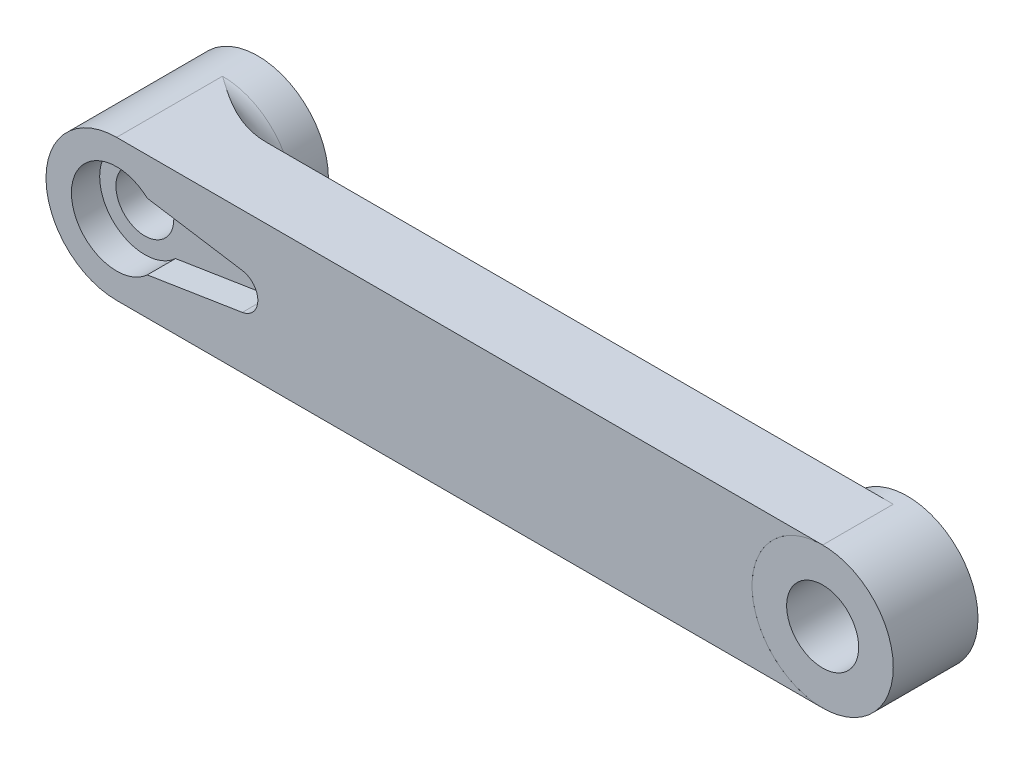
ISO-10303-21;
HEADER;
FILE_DESCRIPTION(('STEP AP214'),'2;1');
FILE_NAME('part.step','',(''),(''),'','','');
FILE_SCHEMA(('AUTOMOTIVE_DESIGN { 1 0 10303 214 1 1 1 1 }'));
ENDSEC;
DATA;
#1=APPLICATION_CONTEXT('core data for automotive mechanical design processes');
#2=APPLICATION_PROTOCOL_DEFINITION('international standard','automotive_design',2000,#1);
#3=PRODUCT_CONTEXT('',#1,'mechanical');
#4=PRODUCT('Part','Part','',(#3));
#5=PRODUCT_RELATED_PRODUCT_CATEGORY('part','',(#4));
#6=PRODUCT_DEFINITION_FORMATION('','',#4);
#7=PRODUCT_DEFINITION_CONTEXT('part definition',#1,'design');
#8=PRODUCT_DEFINITION('design','',#6,#7);
#9=PRODUCT_DEFINITION_SHAPE('','',#8);
#10=(LENGTH_UNIT() NAMED_UNIT(*) SI_UNIT(.MILLI.,.METRE.));
#11=(NAMED_UNIT(*) PLANE_ANGLE_UNIT() SI_UNIT($,.RADIAN.));
#12=(NAMED_UNIT(*) SI_UNIT($,.STERADIAN.) SOLID_ANGLE_UNIT());
#13=UNCERTAINTY_MEASURE_WITH_UNIT(LENGTH_MEASURE(1.E-05),#10,'distance_accuracy_value','');
#14=(GEOMETRIC_REPRESENTATION_CONTEXT(3) GLOBAL_UNCERTAINTY_ASSIGNED_CONTEXT((#13)) GLOBAL_UNIT_ASSIGNED_CONTEXT((#10,
#11,#12)) REPRESENTATION_CONTEXT('',''));
#15=CARTESIAN_POINT('',(0.,0.,0.));
#16=DIRECTION('',(0.,0.,1.));
#17=DIRECTION('',(1.,0.,0.));
#18=AXIS2_PLACEMENT_3D('',#15,#16,#17);
#19=CARTESIAN_POINT('',(100.,0.,-12.));
#20=DIRECTION('',(0.,0.,1.));
#21=DIRECTION('',(1.,0.,0.));
#22=AXIS2_PLACEMENT_3D('',#19,#20,#21);
#23=CYLINDRICAL_SURFACE('',#22,5.1);
#24=CARTESIAN_POINT('',(100.,0.,-12.));
#25=DIRECTION('',(0.,0.,1.));
#26=DIRECTION('',(1.,0.,0.));
#27=AXIS2_PLACEMENT_3D('',#24,#25,#26);
#28=CIRCLE('',#27,5.1);
#29=CARTESIAN_POINT('',(105.1,0.,-12.));
#30=VERTEX_POINT('',#29);
#31=EDGE_CURVE('E51',#30,#30,#28,.T.);
#32=ORIENTED_EDGE('',*,*,#31,.F.);
#33=EDGE_LOOP('',(#32));
#34=FACE_BOUND('',#33,.T.);
#35=CARTESIAN_POINT('',(100.,0.,0.));
#36=DIRECTION('',(0.,0.,1.));
#37=DIRECTION('',(1.,0.,0.));
#38=AXIS2_PLACEMENT_3D('',#35,#36,#37);
#39=CIRCLE('',#38,5.1);
#40=CARTESIAN_POINT('',(105.1,0.,0.));
#41=VERTEX_POINT('',#40);
#42=EDGE_CURVE('E57',#41,#41,#39,.T.);
#43=ORIENTED_EDGE('',*,*,#42,.T.);
#44=EDGE_LOOP('',(#43));
#45=FACE_BOUND('',#44,.T.);
#46=ADVANCED_FACE('F44',(#34,#45),#23,.F.);
#47=CARTESIAN_POINT('',(100.,0.,-12.));
#48=DIRECTION('',(0.,0.,1.));
#49=DIRECTION('',(1.,0.,0.));
#50=AXIS2_PLACEMENT_3D('',#47,#48,#49);
#51=CYLINDRICAL_SURFACE('',#50,9.99999999999999);
#52=CARTESIAN_POINT('',(100.,0.,-12.));
#53=DIRECTION('',(0.,0.,1.));
#54=DIRECTION('',(1.,0.,0.));
#55=AXIS2_PLACEMENT_3D('',#52,#53,#54);
#56=CIRCLE('',#55,9.99999999999999);
#57=CARTESIAN_POINT('',(110.,0.,-12.));
#58=VERTEX_POINT('',#57);
#59=EDGE_CURVE('E11',#58,#58,#56,.T.);
#60=ORIENTED_EDGE('',*,*,#59,.T.);
#61=EDGE_LOOP('',(#60));
#62=FACE_BOUND('',#61,.T.);
#63=CARTESIAN_POINT('',(100.,0.,0.));
#64=DIRECTION('',(0.,0.,1.));
#65=DIRECTION('',(1.,0.,0.));
#66=AXIS2_PLACEMENT_3D('',#63,#64,#65);
#67=CIRCLE('',#66,9.99999999999999);
#68=CARTESIAN_POINT('',(110.,0.,0.));
#69=VERTEX_POINT('',#68);
#70=EDGE_CURVE('E47',#69,#69,#67,.T.);
#71=ORIENTED_EDGE('',*,*,#70,.F.);
#72=EDGE_LOOP('',(#71));
#73=FACE_BOUND('',#72,.T.);
#74=ADVANCED_FACE('F66',(#62,#73),#51,.T.);
#75=CARTESIAN_POINT('',(0.,0.,-12.));
#76=DIRECTION('',(0.,0.,1.));
#77=DIRECTION('',(1.,0.,0.));
#78=AXIS2_PLACEMENT_3D('',#75,#76,#77);
#79=PLANE('',#78);
#80=ORIENTED_EDGE('',*,*,#31,.T.);
#81=EDGE_LOOP('',(#80));
#82=FACE_BOUND('',#81,.T.);
#83=ORIENTED_EDGE('',*,*,#59,.F.);
#84=EDGE_LOOP('',(#83));
#85=FACE_BOUND('',#84,.T.);
#86=ADVANCED_FACE('F68',(#82,#85),#79,.F.);
#87=CARTESIAN_POINT('',(0.,0.,0.));
#88=DIRECTION('',(0.,0.,1.));
#89=DIRECTION('',(1.,0.,0.));
#90=AXIS2_PLACEMENT_3D('',#87,#88,#89);
#91=PLANE('',#90);
#92=ORIENTED_EDGE('',*,*,#42,.F.);
#93=EDGE_LOOP('',(#92));
#94=FACE_BOUND('',#93,.T.);
#95=ORIENTED_EDGE('',*,*,#70,.T.);
#96=EDGE_LOOP('',(#95));
#97=FACE_BOUND('',#96,.T.);
#98=ADVANCED_FACE('F64',(#94,#97),#91,.T.);
#99=CLOSED_SHELL('',(#46,#74,#86,#98));
#100=MANIFOLD_SOLID_BREP('B2',#99);
#101=CARTESIAN_POINT('',(0.,0.,-20.));
#102=DIRECTION('',(0.,0.,1.));
#103=DIRECTION('',(1.,0.,0.));
#104=AXIS2_PLACEMENT_3D('',#101,#102,#103);
#105=CYLINDRICAL_SURFACE('',#104,4.1);
#106=CARTESIAN_POINT('',(0.,0.,-19.));
#107=DIRECTION('',(0.,0.,1.));
#108=DIRECTION('',(1.,0.,0.));
#109=AXIS2_PLACEMENT_3D('',#106,#107,#108);
#110=CIRCLE('',#109,4.1);
#111=CARTESIAN_POINT('',(4.1,0.,-19.));
#112=VERTEX_POINT('',#111);
#113=EDGE_CURVE('E257',#112,#112,#110,.F.);
#114=ORIENTED_EDGE('',*,*,#113,.T.);
#115=EDGE_LOOP('',(#114));
#116=FACE_BOUND('',#115,.T.);
#117=CARTESIAN_POINT('',(0.,0.,-4.));
#118=DIRECTION('',(0.,0.,1.));
#119=DIRECTION('',(1.,0.,0.));
#120=AXIS2_PLACEMENT_3D('',#117,#118,#119);
#121=CIRCLE('',#120,4.1);
#122=CARTESIAN_POINT('',(4.1,0.,-4.));
#123=VERTEX_POINT('',#122);
#124=EDGE_CURVE('E200',#123,#123,#121,.F.);
#125=ORIENTED_EDGE('',*,*,#124,.F.);
#126=EDGE_LOOP('',(#125));
#127=FACE_BOUND('',#126,.T.);
#128=ADVANCED_FACE('F105',(#116,#127),#105,.F.);
#129=CARTESIAN_POINT('',(0.,0.,-20.));
#130=DIRECTION('',(0.,0.,1.));
#131=DIRECTION('',(1.,0.,0.));
#132=AXIS2_PLACEMENT_3D('',#129,#130,#131);
#133=CYLINDRICAL_SURFACE('',#132,10.);
#134=CARTESIAN_POINT('',(0.,0.,-20.));
#135=DIRECTION('',(0.,0.,1.));
#136=DIRECTION('',(1.,0.,0.));
#137=AXIS2_PLACEMENT_3D('',#134,#135,#136);
#138=CIRCLE('',#137,10.);
#139=CARTESIAN_POINT('',(10.,0.,-20.));
#140=VERTEX_POINT('',#139);
#141=EDGE_CURVE('E249',#140,#140,#138,.T.);
#142=ORIENTED_EDGE('',*,*,#141,.T.);
#143=EDGE_LOOP('',(#142));
#144=FACE_BOUND('',#143,.T.);
#145=DIRECTION('',(0.,0.,1.));
#146=VECTOR('',#145,1.);
#147=CARTESIAN_POINT('',(0.,10.,-10.));
#148=LINE('',#147,#146);
#149=CARTESIAN_POINT('',(0.,10.,-15.));
#150=VERTEX_POINT('',#149);
#151=CARTESIAN_POINT('',(0.,10.,0.));
#152=VERTEX_POINT('',#151);
#153=EDGE_CURVE('E125',#150,#152,#148,.T.);
#154=ORIENTED_EDGE('',*,*,#153,.F.);
#155=CARTESIAN_POINT('',(0.,0.,-15.));
#156=DIRECTION('',(0.,0.,1.));
#157=DIRECTION('',(1.,0.,0.));
#158=AXIS2_PLACEMENT_3D('',#155,#156,#157);
#159=CIRCLE('',#158,10.);
#160=CARTESIAN_POINT('',(0.,-10.,-15.));
#161=VERTEX_POINT('',#160);
#162=EDGE_CURVE('E263',#150,#161,#159,.F.);
#163=ORIENTED_EDGE('',*,*,#162,.T.);
#164=DIRECTION('',(0.,0.,1.));
#165=VECTOR('',#164,1.);
#166=CARTESIAN_POINT('',(0.,-10.,-10.));
#167=LINE('',#166,#165);
#168=CARTESIAN_POINT('',(0.,-10.,0.));
#169=VERTEX_POINT('',#168);
#170=EDGE_CURVE('E132',#161,#169,#167,.T.);
#171=ORIENTED_EDGE('',*,*,#170,.T.);
#172=CARTESIAN_POINT('',(0.,0.,0.));
#173=DIRECTION('',(0.,0.,1.));
#174=DIRECTION('',(1.,0.,0.));
#175=AXIS2_PLACEMENT_3D('',#172,#173,#174);
#176=CIRCLE('',#175,10.);
#177=EDGE_CURVE('E242',#152,#169,#176,.T.);
#178=ORIENTED_EDGE('',*,*,#177,.F.);
#179=EDGE_LOOP('',(#154,#163,#171,#178));
#180=FACE_BOUND('',#179,.T.);
#181=ADVANCED_FACE('F287',(#144,#180),#133,.T.);
#182=CARTESIAN_POINT('',(0.,0.,-20.));
#183=DIRECTION('',(0.,0.,1.));
#184=DIRECTION('',(1.,0.,0.));
#185=AXIS2_PLACEMENT_3D('',#182,#183,#184);
#186=PLANE('',#185);
#187=CARTESIAN_POINT('',(0.,0.,-20.));
#188=DIRECTION('',(0.,0.,1.));
#189=DIRECTION('',(1.,0.,0.));
#190=AXIS2_PLACEMENT_3D('',#187,#188,#189);
#191=CIRCLE('',#190,5.10000000000001);
#192=CARTESIAN_POINT('',(5.10000000000001,0.,-20.));
#193=VERTEX_POINT('',#192);
#194=EDGE_CURVE('E252',#193,#193,#191,.T.);
#195=ORIENTED_EDGE('',*,*,#194,.T.);
#196=EDGE_LOOP('',(#195));
#197=FACE_BOUND('',#196,.T.);
#198=ORIENTED_EDGE('',*,*,#141,.F.);
#199=EDGE_LOOP('',(#198));
#200=FACE_BOUND('',#199,.T.);
#201=ADVANCED_FACE('F284',(#197,#200),#186,.F.);
#202=CARTESIAN_POINT('',(0.,0.,0.));
#203=DIRECTION('',(0.,0.,1.));
#204=DIRECTION('',(1.,0.,0.));
#205=AXIS2_PLACEMENT_3D('',#202,#203,#204);
#206=PLANE('',#205);
#207=CARTESIAN_POINT('',(17.4,0.,0.));
#208=DIRECTION('',(0.,0.,1.));
#209=DIRECTION('',(1.,0.,0.));
#210=AXIS2_PLACEMENT_3D('',#207,#208,#209);
#211=CIRCLE('',#210,2.6);
#212=CARTESIAN_POINT('',(17.8067296091046,-2.56798968554736,0.));
#213=VERTEX_POINT('',#212);
#214=CARTESIAN_POINT('',(17.8067296091046,2.56798968554736,0.));
#215=VERTEX_POINT('',#214);
#216=EDGE_CURVE('E199',#213,#215,#211,.T.);
#217=ORIENTED_EDGE('',*,*,#216,.F.);
#218=DIRECTION('',(0.987688340595138,0.156434465040231,0.));
#219=VECTOR('',#218,1.);
#220=CARTESIAN_POINT('',(0.832537917336765,-5.2564375366094,0.));
#221=LINE('',#220,#219);
#222=CARTESIAN_POINT('',(4.34359215751142,-4.70034117583025,0.));
#223=VERTEX_POINT('',#222);
#224=EDGE_CURVE('E206',#223,#213,#221,.T.);
#225=ORIENTED_EDGE('',*,*,#224,.F.);
#226=CARTESIAN_POINT('',(0.,0.,0.));
#227=DIRECTION('',(0.,0.,1.));
#228=DIRECTION('',(1.,0.,0.));
#229=AXIS2_PLACEMENT_3D('',#226,#227,#228);
#230=CIRCLE('',#229,6.4);
#231=CARTESIAN_POINT('',(4.34359215751142,4.70034117583025,0.));
#232=VERTEX_POINT('',#231);
#233=EDGE_CURVE('E209',#232,#223,#230,.T.);
#234=ORIENTED_EDGE('',*,*,#233,.F.);
#235=DIRECTION('',(0.987688340595138,-0.156434465040231,0.));
#236=VECTOR('',#235,1.);
#237=CARTESIAN_POINT('',(0.832537917336765,5.2564375366094,0.));
#238=LINE('',#237,#236);
#239=EDGE_CURVE('E217',#232,#215,#238,.T.);
#240=ORIENTED_EDGE('',*,*,#239,.T.);
#241=EDGE_LOOP('',(#217,#225,#234,#240));
#242=FACE_BOUND('',#241,.T.);
#243=ORIENTED_EDGE('',*,*,#177,.T.);
#244=DIRECTION('',(1.,0.,0.));
#245=VECTOR('',#244,1.);
#246=CARTESIAN_POINT('',(0.,-10.,0.));
#247=LINE('',#246,#245);
#248=CARTESIAN_POINT('',(100.,-9.99999999999999,0.));
#249=VERTEX_POINT('',#248);
#250=EDGE_CURVE('E223',#169,#249,#247,.T.);
#251=ORIENTED_EDGE('',*,*,#250,.T.);
#252=CARTESIAN_POINT('',(100.,0.,0.));
#253=DIRECTION('',(0.,0.,1.));
#254=DIRECTION('',(1.,0.,0.));
#255=AXIS2_PLACEMENT_3D('',#252,#253,#254);
#256=CIRCLE('',#255,9.99999999999999);
#257=CARTESIAN_POINT('',(100.,9.99999999999999,0.));
#258=VERTEX_POINT('',#257);
#259=EDGE_CURVE('E237',#258,#249,#256,.T.);
#260=ORIENTED_EDGE('',*,*,#259,.F.);
#261=DIRECTION('',(1.,0.,0.));
#262=VECTOR('',#261,1.);
#263=CARTESIAN_POINT('',(0.,10.,0.));
#264=LINE('',#263,#262);
#265=EDGE_CURVE('E230',#152,#258,#264,.T.);
#266=ORIENTED_EDGE('',*,*,#265,.F.);
#267=EDGE_LOOP('',(#243,#251,#260,#266));
#268=FACE_BOUND('',#267,.T.);
#269=ADVANCED_FACE('F274',(#242,#268),#206,.T.);
#270=CARTESIAN_POINT('',(0.,10.,-10.));
#271=DIRECTION('',(0.,-1.,0.));
#272=DIRECTION('',(1.,0.,0.));
#273=AXIS2_PLACEMENT_3D('',#270,#271,#272);
#274=PLANE('',#273);
#275=ORIENTED_EDGE('',*,*,#265,.T.);
#276=DIRECTION('',(0.,0.,1.));
#277=VECTOR('',#276,1.);
#278=CARTESIAN_POINT('',(100.,9.99999999999999,-10.));
#279=LINE('',#278,#277);
#280=CARTESIAN_POINT('',(100.,9.99999999999999,-10.));
#281=VERTEX_POINT('',#280);
#282=EDGE_CURVE('E243',#281,#258,#279,.T.);
#283=ORIENTED_EDGE('',*,*,#282,.F.);
#284=DIRECTION('',(1.,0.,0.));
#285=VECTOR('',#284,1.);
#286=CARTESIAN_POINT('',(0.,10.,-10.));
#287=LINE('',#286,#285);
#288=CARTESIAN_POINT('',(11.1803398874989,10.,-10.));
#289=VERTEX_POINT('',#288);
#290=EDGE_CURVE('E233',#289,#281,#287,.T.);
#291=ORIENTED_EDGE('',*,*,#290,.F.);
#292=CARTESIAN_POINT('',(11.1803398874989,10.,-10.));
#293=CARTESIAN_POINT('',(10.8833418810393,10.,-10.0000299623993));
#294=CARTESIAN_POINT('',(10.586723603073,10.,-10.0146927876897));
#295=CARTESIAN_POINT('',(9.99650368330965,10.,-10.0702146909149));
#296=CARTESIAN_POINT('',(9.7028972040913,10.,-10.1110214521143));
#297=CARTESIAN_POINT('',(8.83797284787225,10.,-10.2664109142398));
#298=CARTESIAN_POINT('',(8.27249718229531,10.,-10.4141798049535));
#299=CARTESIAN_POINT('',(7.41580997338312,10.,-10.6955481168027));
#300=CARTESIAN_POINT('',(7.11620351047925,10.,-10.8053404310762));
#301=CARTESIAN_POINT('',(6.52395825241381,10.,-11.0424122981148));
#302=CARTESIAN_POINT('',(6.23131919380734,10.,-11.169691188458));
#303=CARTESIAN_POINT('',(5.36306780758409,10.,-11.5738498936846));
#304=CARTESIAN_POINT('',(4.79777598845146,10.,-11.8728243117631));
#305=CARTESIAN_POINT('',(3.68544002130758,10.,-12.5128801469089));
#306=CARTESIAN_POINT('',(3.13860738175161,10.,-12.8543182334579));
#307=CARTESIAN_POINT('',(2.06078067546994,10.,-13.5604488420561));
#308=CARTESIAN_POINT('',(1.52977958409369,10.,-13.9251308181446));
#309=CARTESIAN_POINT('',(0.672566535979779,10.,-14.5244681553938));
#310=CARTESIAN_POINT('',(0.344440515491117,10.,-14.7564445011615));
#311=CARTESIAN_POINT('',(0.0108866222775107,10.,-14.9923019952232));
#312=CARTESIAN_POINT('',(0.00544331176375164,10.,-14.9961509970116));
#313=CARTESIAN_POINT('',(0.,10.,-15.));
#314=B_SPLINE_CURVE_WITH_KNOTS('',3,(#292,#293,#294,#295,#296,#297,#298,#299,#300,#301,#302,
#303,#304,#305,#306,#307,#308,#309,#310,#311,#312,#313),.UNSPECIFIED.,.F.,.F.,(4,2,2,2,2,2,2,2,
2,2,4),(0.,0.890035292464625,1.77829507120259,3.52501481011829,4.48189649503703,
5.43874194160516,7.35450080314867,9.28760187109391,11.2198320325017,12.4253863415644,
12.4453863415646),.UNSPECIFIED.);
#315=EDGE_CURVE('E118',#289,#150,#314,.T.);
#316=ORIENTED_EDGE('',*,*,#315,.T.);
#317=ORIENTED_EDGE('',*,*,#153,.T.);
#318=EDGE_LOOP('',(#275,#283,#291,#316,#317));
#319=FACE_BOUND('',#318,.T.);
#320=ADVANCED_FACE('F268',(#319),#274,.F.);
#321=CARTESIAN_POINT('',(100.,0.,-10.));
#322=DIRECTION('',(0.,0.,1.));
#323=DIRECTION('',(1.,0.,0.));
#324=AXIS2_PLACEMENT_3D('',#321,#322,#323);
#325=CYLINDRICAL_SURFACE('',#324,9.99999999999999);
#326=ORIENTED_EDGE('',*,*,#259,.T.);
#327=DIRECTION('',(0.,0.,1.));
#328=VECTOR('',#327,1.);
#329=CARTESIAN_POINT('',(100.,-9.99999999999999,-10.));
#330=LINE('',#329,#328);
#331=CARTESIAN_POINT('',(100.,-9.99999999999999,-10.));
#332=VERTEX_POINT('',#331);
#333=EDGE_CURVE('E246',#332,#249,#330,.T.);
#334=ORIENTED_EDGE('',*,*,#333,.F.);
#335=CARTESIAN_POINT('',(100.,0.,-10.));
#336=DIRECTION('',(0.,0.,1.));
#337=DIRECTION('',(1.,0.,0.));
#338=AXIS2_PLACEMENT_3D('',#335,#336,#337);
#339=CIRCLE('',#338,9.99999999999999);
#340=EDGE_CURVE('E229',#281,#332,#339,.T.);
#341=ORIENTED_EDGE('',*,*,#340,.F.);
#342=ORIENTED_EDGE('',*,*,#282,.T.);
#343=EDGE_LOOP('',(#326,#334,#341,#342));
#344=FACE_BOUND('',#343,.T.);
#345=ADVANCED_FACE('F273',(#344),#325,.F.);
#346=CARTESIAN_POINT('',(0.,-10.,-10.));
#347=DIRECTION('',(0.,-1.,0.));
#348=DIRECTION('',(1.,0.,0.));
#349=AXIS2_PLACEMENT_3D('',#346,#347,#348);
#350=PLANE('',#349);
#351=ORIENTED_EDGE('',*,*,#250,.F.);
#352=ORIENTED_EDGE('',*,*,#170,.F.);
#353=CARTESIAN_POINT('',(11.1803398874989,-10.,-10.));
#354=CARTESIAN_POINT('',(10.8833418810393,-10.,-10.0000299623993));
#355=CARTESIAN_POINT('',(10.586723603073,-10.,-10.0146927876897));
#356=CARTESIAN_POINT('',(9.99650368330965,-10.,-10.0702146909149));
#357=CARTESIAN_POINT('',(9.7028972040913,-10.,-10.1110214521143));
#358=CARTESIAN_POINT('',(8.83797284787225,-10.,-10.2664109142398));
#359=CARTESIAN_POINT('',(8.27249718229531,-10.,-10.4141798049535));
#360=CARTESIAN_POINT('',(7.41580997338312,-10.,-10.6955481168027));
#361=CARTESIAN_POINT('',(7.11620351047925,-10.,-10.8053404310762));
#362=CARTESIAN_POINT('',(6.52395825241381,-10.,-11.0424122981148));
#363=CARTESIAN_POINT('',(6.23131919380734,-10.,-11.169691188458));
#364=CARTESIAN_POINT('',(5.36306780758409,-10.,-11.5738498936846));
#365=CARTESIAN_POINT('',(4.79777598845146,-10.,-11.8728243117631));
#366=CARTESIAN_POINT('',(3.68544002130758,-10.,-12.5128801469089));
#367=CARTESIAN_POINT('',(3.13860738175161,-10.,-12.8543182334579));
#368=CARTESIAN_POINT('',(2.06078067546994,-10.,-13.5604488420561));
#369=CARTESIAN_POINT('',(1.52977958409369,-10.,-13.9251308181446));
#370=CARTESIAN_POINT('',(0.672566535979779,-10.,-14.5244681553938));
#371=CARTESIAN_POINT('',(0.344440515491117,-10.,-14.7564445011615));
#372=CARTESIAN_POINT('',(0.0108866222775107,-10.,-14.9923019952232));
#373=CARTESIAN_POINT('',(0.00544331176375164,-10.,-14.9961509970116));
#374=CARTESIAN_POINT('',(0.,-10.,-15.));
#375=B_SPLINE_CURVE_WITH_KNOTS('',3,(#353,#354,#355,#356,#357,#358,#359,#360,#361,#362,#363,
#364,#365,#366,#367,#368,#369,#370,#371,#372,#373,#374),.UNSPECIFIED.,.F.,.F.,(4,2,2,2,2,2,2,2,
2,2,4),(0.,0.890035292464625,1.77829507120259,3.52501481011829,4.48189649503703,
5.43874194160516,7.35450080314867,9.28760187109391,11.2198320325017,12.4253863415644,
12.4453863415646),.UNSPECIFIED.);
#376=CARTESIAN_POINT('',(11.1803398874989,-10.,-10.));
#377=VERTEX_POINT('',#376);
#378=EDGE_CURVE('E42',#161,#377,#375,.F.);
#379=ORIENTED_EDGE('',*,*,#378,.T.);
#380=DIRECTION('',(1.,0.,0.));
#381=VECTOR('',#380,1.);
#382=CARTESIAN_POINT('',(0.,-10.,-10.));
#383=LINE('',#382,#381);
#384=EDGE_CURVE('E227',#377,#332,#383,.T.);
#385=ORIENTED_EDGE('',*,*,#384,.T.);
#386=ORIENTED_EDGE('',*,*,#333,.T.);
#387=EDGE_LOOP('',(#351,#352,#379,#385,#386));
#388=FACE_BOUND('',#387,.T.);
#389=ADVANCED_FACE('F279',(#388),#350,.T.);
#390=CARTESIAN_POINT('',(0.,0.,-10.));
#391=DIRECTION('',(0.,0.,1.));
#392=DIRECTION('',(1.,0.,0.));
#393=AXIS2_PLACEMENT_3D('',#390,#391,#392);
#394=PLANE('',#393);
#395=ORIENTED_EDGE('',*,*,#384,.F.);
#396=CARTESIAN_POINT('',(0.,0.,-10.));
#397=DIRECTION('',(0.,0.,1.));
#398=DIRECTION('',(1.,0.,0.));
#399=AXIS2_PLACEMENT_3D('',#396,#397,#398);
#400=CIRCLE('',#399,15.);
#401=EDGE_CURVE('E260',#377,#289,#400,.T.);
#402=ORIENTED_EDGE('',*,*,#401,.T.);
#403=ORIENTED_EDGE('',*,*,#290,.T.);
#404=ORIENTED_EDGE('',*,*,#340,.T.);
#405=EDGE_LOOP('',(#395,#402,#403,#404));
#406=FACE_BOUND('',#405,.T.);
#407=ADVANCED_FACE('F276',(#406),#394,.F.);
#408=CARTESIAN_POINT('',(17.4,0.,-4.));
#409=DIRECTION('',(0.,0.,1.));
#410=DIRECTION('',(1.,0.,0.));
#411=AXIS2_PLACEMENT_3D('',#408,#409,#410);
#412=CYLINDRICAL_SURFACE('',#411,2.6);
#413=ORIENTED_EDGE('',*,*,#216,.T.);
#414=DIRECTION('',(0.,0.,1.));
#415=VECTOR('',#414,1.);
#416=CARTESIAN_POINT('',(17.8067296091046,2.56798968554736,-4.));
#417=LINE('',#416,#415);
#418=CARTESIAN_POINT('',(17.8067296091046,2.56798968554736,-4.));
#419=VERTEX_POINT('',#418);
#420=EDGE_CURVE('E184',#419,#215,#417,.T.);
#421=ORIENTED_EDGE('',*,*,#420,.F.);
#422=CARTESIAN_POINT('',(17.4,0.,-4.));
#423=DIRECTION('',(0.,0.,1.));
#424=DIRECTION('',(1.,0.,0.));
#425=AXIS2_PLACEMENT_3D('',#422,#423,#424);
#426=CIRCLE('',#425,2.6);
#427=CARTESIAN_POINT('',(17.8067296091046,-2.56798968554736,-4.));
#428=VERTEX_POINT('',#427);
#429=EDGE_CURVE('E192',#428,#419,#426,.T.);
#430=ORIENTED_EDGE('',*,*,#429,.F.);
#431=DIRECTION('',(0.,0.,1.));
#432=VECTOR('',#431,1.);
#433=CARTESIAN_POINT('',(17.8067296091046,-2.56798968554736,-4.));
#434=LINE('',#433,#432);
#435=EDGE_CURVE('E221',#428,#213,#434,.T.);
#436=ORIENTED_EDGE('',*,*,#435,.T.);
#437=EDGE_LOOP('',(#413,#421,#430,#436));
#438=FACE_BOUND('',#437,.T.);
#439=ADVANCED_FACE('F196',(#438),#412,.F.);
#440=CARTESIAN_POINT('',(0.832537917336765,-5.2564375366094,-4.));
#441=DIRECTION('',(0.156434465040231,-0.987688340595138,0.));
#442=DIRECTION('',(0.987688340595138,0.156434465040231,0.));
#443=AXIS2_PLACEMENT_3D('',#440,#441,#442);
#444=PLANE('',#443);
#445=ORIENTED_EDGE('',*,*,#224,.T.);
#446=ORIENTED_EDGE('',*,*,#435,.F.);
#447=DIRECTION('',(0.987688340595138,0.156434465040231,0.));
#448=VECTOR('',#447,1.);
#449=CARTESIAN_POINT('',(0.832537917336765,-5.2564375366094,-4.));
#450=LINE('',#449,#448);
#451=CARTESIAN_POINT('',(4.34359215751142,-4.70034117583025,-4.));
#452=VERTEX_POINT('',#451);
#453=EDGE_CURVE('E205',#452,#428,#450,.T.);
#454=ORIENTED_EDGE('',*,*,#453,.F.);
#455=DIRECTION('',(0.,0.,1.));
#456=VECTOR('',#455,1.);
#457=CARTESIAN_POINT('',(4.34359215751142,-4.70034117583025,-4.));
#458=LINE('',#457,#456);
#459=EDGE_CURVE('E224',#452,#223,#458,.T.);
#460=ORIENTED_EDGE('',*,*,#459,.T.);
#461=EDGE_LOOP('',(#445,#446,#454,#460));
#462=FACE_BOUND('',#461,.T.);
#463=ADVANCED_FACE('F319',(#462),#444,.F.);
#464=CARTESIAN_POINT('',(0.,0.,-4.));
#465=DIRECTION('',(0.,0.,1.));
#466=DIRECTION('',(1.,0.,0.));
#467=AXIS2_PLACEMENT_3D('',#464,#465,#466);
#468=CYLINDRICAL_SURFACE('',#467,6.4);
#469=ORIENTED_EDGE('',*,*,#233,.T.);
#470=ORIENTED_EDGE('',*,*,#459,.F.);
#471=CARTESIAN_POINT('',(0.,0.,-4.));
#472=DIRECTION('',(0.,0.,1.));
#473=DIRECTION('',(1.,0.,0.));
#474=AXIS2_PLACEMENT_3D('',#471,#472,#473);
#475=CIRCLE('',#474,6.4);
#476=CARTESIAN_POINT('',(4.34359215751142,4.70034117583025,-4.));
#477=VERTEX_POINT('',#476);
#478=EDGE_CURVE('E191',#477,#452,#475,.T.);
#479=ORIENTED_EDGE('',*,*,#478,.F.);
#480=DIRECTION('',(0.,0.,1.));
#481=VECTOR('',#480,1.);
#482=CARTESIAN_POINT('',(4.34359215751142,4.70034117583025,-4.));
#483=LINE('',#482,#481);
#484=EDGE_CURVE('E186',#477,#232,#483,.T.);
#485=ORIENTED_EDGE('',*,*,#484,.T.);
#486=EDGE_LOOP('',(#469,#470,#479,#485));
#487=FACE_BOUND('',#486,.T.);
#488=ADVANCED_FACE('F316',(#487),#468,.F.);
#489=CARTESIAN_POINT('',(0.832537917336765,5.2564375366094,-4.));
#490=DIRECTION('',(-0.156434465040231,-0.987688340595138,0.));
#491=DIRECTION('',(0.987688340595138,-0.156434465040231,0.));
#492=AXIS2_PLACEMENT_3D('',#489,#490,#491);
#493=PLANE('',#492);
#494=ORIENTED_EDGE('',*,*,#239,.F.);
#495=ORIENTED_EDGE('',*,*,#484,.F.);
#496=DIRECTION('',(0.987688340595138,-0.156434465040231,0.));
#497=VECTOR('',#496,1.);
#498=CARTESIAN_POINT('',(0.832537917336765,5.2564375366094,-4.));
#499=LINE('',#498,#497);
#500=EDGE_CURVE('E180',#477,#419,#499,.T.);
#501=ORIENTED_EDGE('',*,*,#500,.T.);
#502=ORIENTED_EDGE('',*,*,#420,.T.);
#503=EDGE_LOOP('',(#494,#495,#501,#502));
#504=FACE_BOUND('',#503,.T.);
#505=ADVANCED_FACE('F183',(#504),#493,.T.);
#506=CARTESIAN_POINT('',(0.,0.,-4.));
#507=DIRECTION('',(0.,0.,1.));
#508=DIRECTION('',(1.,0.,0.));
#509=AXIS2_PLACEMENT_3D('',#506,#507,#508);
#510=PLANE('',#509);
#511=ORIENTED_EDGE('',*,*,#429,.T.);
#512=ORIENTED_EDGE('',*,*,#500,.F.);
#513=ORIENTED_EDGE('',*,*,#478,.T.);
#514=ORIENTED_EDGE('',*,*,#453,.T.);
#515=EDGE_LOOP('',(#511,#512,#513,#514));
#516=FACE_BOUND('',#515,.T.);
#517=ORIENTED_EDGE('',*,*,#124,.T.);
#518=EDGE_LOOP('',(#517));
#519=FACE_BOUND('',#518,.T.);
#520=ADVANCED_FACE('F202',(#516,#519),#510,.T.);
#521=CARTESIAN_POINT('',(0.,0.,-20.));
#522=DIRECTION('',(0.,0.,-1.));
#523=DIRECTION('',(-1.,0.,0.));
#524=AXIS2_PLACEMENT_3D('',#521,#522,#523);
#525=CONICAL_SURFACE('',#524,5.10000000000001,0.785398163397448);
#526=ORIENTED_EDGE('',*,*,#113,.F.);
#527=EDGE_LOOP('',(#526));
#528=FACE_BOUND('',#527,.T.);
#529=ORIENTED_EDGE('',*,*,#194,.F.);
#530=EDGE_LOOP('',(#529));
#531=FACE_BOUND('',#530,.T.);
#532=ADVANCED_FACE('F297',(#528,#531),#525,.F.);
#533=CARTESIAN_POINT('',(0.,0.,-15.));
#534=DIRECTION('',(0.,0.,1.));
#535=DIRECTION('',(1.,0.,0.));
#536=AXIS2_PLACEMENT_3D('',#533,#534,#535);
#537=TOROIDAL_SURFACE('',#536,15.,5.);
#538=ORIENTED_EDGE('',*,*,#378,.F.);
#539=ORIENTED_EDGE('',*,*,#162,.F.);
#540=ORIENTED_EDGE('',*,*,#315,.F.);
#541=ORIENTED_EDGE('',*,*,#401,.F.);
#542=EDGE_LOOP('',(#538,#539,#540,#541));
#543=FACE_BOUND('',#542,.T.);
#544=ADVANCED_FACE('F107',(#543),#537,.F.);
#545=CLOSED_SHELL('',(#128,#181,#201,#269,#320,#345,#389,#407,#439,#463,#488,#505,#520,#532,#544));
#546=MANIFOLD_SOLID_BREP('B6',#545);
#547=ADVANCED_BREP_SHAPE_REPRESENTATION('',(#18,#100,#546),#14);
#548=SHAPE_DEFINITION_REPRESENTATION(#9,#547);
ENDSEC;
END-ISO-10303-21;
